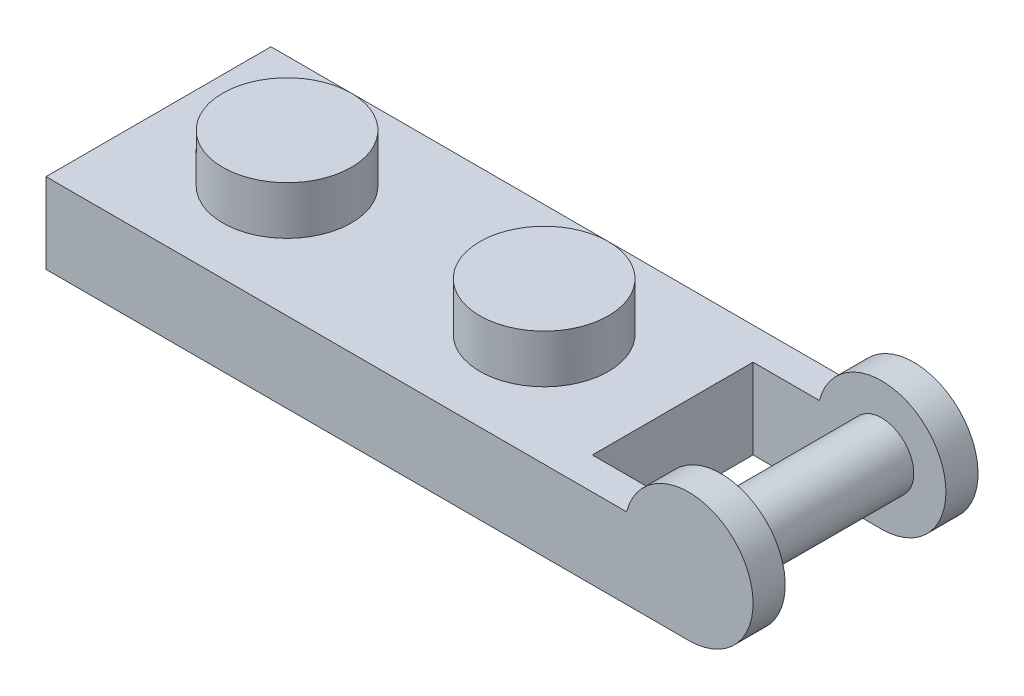
ISO-10303-21;
HEADER;
FILE_DESCRIPTION(('STEP AP214'),'2;1');
FILE_NAME('part.step','',(''),(''),'','','');
FILE_SCHEMA(('AUTOMOTIVE_DESIGN { 1 0 10303 214 1 1 1 1 }'));
ENDSEC;
DATA;
#1=APPLICATION_CONTEXT('core data for automotive mechanical design processes');
#2=APPLICATION_PROTOCOL_DEFINITION('international standard','automotive_design',2000,#1);
#3=PRODUCT_CONTEXT('',#1,'mechanical');
#4=PRODUCT('Part','Part','',(#3));
#5=PRODUCT_RELATED_PRODUCT_CATEGORY('part','',(#4));
#6=PRODUCT_DEFINITION_FORMATION('','',#4);
#7=PRODUCT_DEFINITION_CONTEXT('part definition',#1,'design');
#8=PRODUCT_DEFINITION('design','',#6,#7);
#9=PRODUCT_DEFINITION_SHAPE('','',#8);
#10=(LENGTH_UNIT() NAMED_UNIT(*) SI_UNIT(.MILLI.,.METRE.));
#11=(NAMED_UNIT(*) PLANE_ANGLE_UNIT() SI_UNIT($,.RADIAN.));
#12=(NAMED_UNIT(*) SI_UNIT($,.STERADIAN.) SOLID_ANGLE_UNIT());
#13=UNCERTAINTY_MEASURE_WITH_UNIT(LENGTH_MEASURE(1.E-05),#10,'distance_accuracy_value','');
#14=(GEOMETRIC_REPRESENTATION_CONTEXT(3) GLOBAL_UNCERTAINTY_ASSIGNED_CONTEXT((#13)) GLOBAL_UNIT_ASSIGNED_CONTEXT((#10,
#11,#12)) REPRESENTATION_CONTEXT('',''));
#15=CARTESIAN_POINT('',(0.,0.,0.));
#16=DIRECTION('',(0.,0.,1.));
#17=DIRECTION('',(1.,0.,0.));
#18=AXIS2_PLACEMENT_3D('',#15,#16,#17);
#19=CARTESIAN_POINT('',(10.16,0.,4.445));
#20=DIRECTION('',(-1.,0.,0.));
#21=DIRECTION('',(0.,0.,1.));
#22=AXIS2_PLACEMENT_3D('',#19,#20,#21);
#23=PLANE('',#22);
#24=DIRECTION('',(0.,-1.,0.));
#25=VECTOR('',#24,1.);
#26=CARTESIAN_POINT('',(10.16,-3.175,-3.175));
#27=LINE('',#26,#25);
#28=CARTESIAN_POINT('',(10.16,0.,-3.175));
#29=VERTEX_POINT('',#28);
#30=CARTESIAN_POINT('',(10.16,-3.175,-3.175));
#31=VERTEX_POINT('',#30);
#32=EDGE_CURVE('E76',#29,#31,#27,.T.);
#33=ORIENTED_EDGE('',*,*,#32,.F.);
#34=DIRECTION('',(0.,0.,-1.));
#35=VECTOR('',#34,1.);
#36=CARTESIAN_POINT('',(10.16,0.,4.445));
#37=LINE('',#36,#35);
#38=CARTESIAN_POINT('',(10.16,0.,3.175));
#39=VERTEX_POINT('',#38);
#40=EDGE_CURVE('E167',#39,#29,#37,.T.);
#41=ORIENTED_EDGE('',*,*,#40,.F.);
#42=DIRECTION('',(0.,-1.,0.));
#43=VECTOR('',#42,1.);
#44=CARTESIAN_POINT('',(10.16,-3.175,3.175));
#45=LINE('',#44,#43);
#46=CARTESIAN_POINT('',(10.16,-3.175,3.175));
#47=VERTEX_POINT('',#46);
#48=EDGE_CURVE('E175',#39,#47,#45,.T.);
#49=ORIENTED_EDGE('',*,*,#48,.T.);
#50=DIRECTION('',(0.,0.,-1.));
#51=VECTOR('',#50,1.);
#52=CARTESIAN_POINT('',(10.16,-3.175,4.445));
#53=LINE('',#52,#51);
#54=EDGE_CURVE('E71',#47,#31,#53,.T.);
#55=ORIENTED_EDGE('',*,*,#54,.T.);
#56=EDGE_LOOP('',(#33,#41,#49,#55));
#57=FACE_BOUND('',#56,.T.);
#58=ADVANCED_FACE('F55',(#57),#23,.F.);
#59=CARTESIAN_POINT('',(-10.16,-3.175,4.445));
#60=DIRECTION('',(1.,0.,0.));
#61=DIRECTION('',(0.,0.,-1.));
#62=AXIS2_PLACEMENT_3D('',#59,#60,#61);
#63=PLANE('',#62);
#64=DIRECTION('',(0.,-1.,0.));
#65=VECTOR('',#64,1.);
#66=CARTESIAN_POINT('',(-10.16,-3.175,-4.445));
#67=LINE('',#66,#65);
#68=CARTESIAN_POINT('',(-10.16,0.,-4.445));
#69=VERTEX_POINT('',#68);
#70=CARTESIAN_POINT('',(-10.16,-3.175,-4.445));
#71=VERTEX_POINT('',#70);
#72=EDGE_CURVE('E273',#69,#71,#67,.T.);
#73=ORIENTED_EDGE('',*,*,#72,.T.);
#74=DIRECTION('',(0.,0.,-1.));
#75=VECTOR('',#74,1.);
#76=CARTESIAN_POINT('',(-10.16,-3.175,4.445));
#77=LINE('',#76,#75);
#78=CARTESIAN_POINT('',(-10.16,-3.175,4.445));
#79=VERTEX_POINT('',#78);
#80=EDGE_CURVE('E301',#79,#71,#77,.T.);
#81=ORIENTED_EDGE('',*,*,#80,.F.);
#82=DIRECTION('',(0.,-1.,0.));
#83=VECTOR('',#82,1.);
#84=CARTESIAN_POINT('',(-10.16,-3.175,4.445));
#85=LINE('',#84,#83);
#86=CARTESIAN_POINT('',(-10.16,0.,4.445));
#87=VERTEX_POINT('',#86);
#88=EDGE_CURVE('E274',#87,#79,#85,.T.);
#89=ORIENTED_EDGE('',*,*,#88,.F.);
#90=DIRECTION('',(0.,0.,-1.));
#91=VECTOR('',#90,1.);
#92=CARTESIAN_POINT('',(-10.16,0.,4.445));
#93=LINE('',#92,#91);
#94=EDGE_CURVE('E285',#87,#69,#93,.T.);
#95=ORIENTED_EDGE('',*,*,#94,.T.);
#96=EDGE_LOOP('',(#73,#81,#89,#95));
#97=FACE_BOUND('',#96,.T.);
#98=ADVANCED_FACE('F57',(#97),#63,.F.);
#99=CARTESIAN_POINT('',(10.16,-3.175,4.445));
#100=DIRECTION('',(0.,1.,0.));
#101=DIRECTION('',(0.,0.,1.));
#102=AXIS2_PLACEMENT_3D('',#99,#100,#101);
#103=PLANE('',#102);
#104=DIRECTION('',(0.,0.,-1.));
#105=VECTOR('',#104,1.);
#106=CARTESIAN_POINT('',(-8.89,-3.175,2.54));
#107=LINE('',#106,#105);
#108=CARTESIAN_POINT('',(-8.89,-3.175,2.54));
#109=VERTEX_POINT('',#108);
#110=CARTESIAN_POINT('',(-8.89,-3.175,-2.54));
#111=VERTEX_POINT('',#110);
#112=EDGE_CURVE('E242',#109,#111,#107,.T.);
#113=ORIENTED_EDGE('',*,*,#112,.F.);
#114=DIRECTION('',(-1.,0.,0.));
#115=VECTOR('',#114,1.);
#116=CARTESIAN_POINT('',(8.89,-3.175,2.54));
#117=LINE('',#116,#115);
#118=CARTESIAN_POINT('',(8.89,-3.175,2.54));
#119=VERTEX_POINT('',#118);
#120=EDGE_CURVE('E210',#119,#109,#117,.T.);
#121=ORIENTED_EDGE('',*,*,#120,.F.);
#122=DIRECTION('',(0.,0.,1.));
#123=VECTOR('',#122,1.);
#124=CARTESIAN_POINT('',(8.89,-3.175,-2.54));
#125=LINE('',#124,#123);
#126=CARTESIAN_POINT('',(8.89,-3.175,-2.54));
#127=VERTEX_POINT('',#126);
#128=EDGE_CURVE('E227',#127,#119,#125,.T.);
#129=ORIENTED_EDGE('',*,*,#128,.F.);
#130=DIRECTION('',(1.,0.,0.));
#131=VECTOR('',#130,1.);
#132=CARTESIAN_POINT('',(-8.89,-3.175,-2.54));
#133=LINE('',#132,#131);
#134=EDGE_CURVE('E246',#111,#127,#133,.T.);
#135=ORIENTED_EDGE('',*,*,#134,.F.);
#136=EDGE_LOOP('',(#113,#121,#129,#135));
#137=FACE_BOUND('',#136,.T.);
#138=DIRECTION('',(1.,0.,0.));
#139=VECTOR('',#138,1.);
#140=CARTESIAN_POINT('',(10.16,-3.175,-4.445));
#141=LINE('',#140,#139);
#142=CARTESIAN_POINT('',(15.24,-3.175,-4.445));
#143=VERTEX_POINT('',#142);
#144=EDGE_CURVE('E289',#71,#143,#141,.T.);
#145=ORIENTED_EDGE('',*,*,#144,.T.);
#146=DIRECTION('',(0.,0.,-1.));
#147=VECTOR('',#146,1.);
#148=CARTESIAN_POINT('',(15.24,-3.175,-3.175));
#149=LINE('',#148,#147);
#150=CARTESIAN_POINT('',(15.24,-3.175,-3.175));
#151=VERTEX_POINT('',#150);
#152=EDGE_CURVE('E163',#151,#143,#149,.T.);
#153=ORIENTED_EDGE('',*,*,#152,.F.);
#154=DIRECTION('',(1.,0.,0.));
#155=VECTOR('',#154,1.);
#156=CARTESIAN_POINT('',(10.16,-3.175,-3.175));
#157=LINE('',#156,#155);
#158=EDGE_CURVE('E151',#31,#151,#157,.T.);
#159=ORIENTED_EDGE('',*,*,#158,.F.);
#160=ORIENTED_EDGE('',*,*,#54,.F.);
#161=DIRECTION('',(1.,0.,0.));
#162=VECTOR('',#161,1.);
#163=CARTESIAN_POINT('',(10.16,-3.175,3.175));
#164=LINE('',#163,#162);
#165=CARTESIAN_POINT('',(15.24,-3.175,3.175));
#166=VERTEX_POINT('',#165);
#167=EDGE_CURVE('E177',#47,#166,#164,.T.);
#168=ORIENTED_EDGE('',*,*,#167,.T.);
#169=DIRECTION('',(0.,0.,1.));
#170=VECTOR('',#169,1.);
#171=CARTESIAN_POINT('',(15.24,-3.175,3.175));
#172=LINE('',#171,#170);
#173=CARTESIAN_POINT('',(15.24,-3.175,4.445));
#174=VERTEX_POINT('',#173);
#175=EDGE_CURVE('E185',#166,#174,#172,.T.);
#176=ORIENTED_EDGE('',*,*,#175,.T.);
#177=DIRECTION('',(1.,0.,0.));
#178=VECTOR('',#177,1.);
#179=CARTESIAN_POINT('',(10.16,-3.175,4.445));
#180=LINE('',#179,#178);
#181=EDGE_CURVE('E278',#79,#174,#180,.T.);
#182=ORIENTED_EDGE('',*,*,#181,.F.);
#183=ORIENTED_EDGE('',*,*,#80,.T.);
#184=EDGE_LOOP('',(#145,#153,#159,#160,#168,#176,#182,#183));
#185=FACE_BOUND('',#184,.T.);
#186=ADVANCED_FACE('F338',(#137,#185),#103,.F.);
#187=CARTESIAN_POINT('',(-10.16,0.,4.445));
#188=DIRECTION('',(0.,-1.,0.));
#189=DIRECTION('',(0.,0.,-1.));
#190=AXIS2_PLACEMENT_3D('',#187,#188,#189);
#191=PLANE('',#190);
#192=CARTESIAN_POINT('',(5.08,0.,0.));
#193=DIRECTION('',(0.,-1.,0.));
#194=DIRECTION('',(0.,0.,-1.));
#195=AXIS2_PLACEMENT_3D('',#192,#193,#194);
#196=CIRCLE('',#195,2.54);
#197=CARTESIAN_POINT('',(5.08,0.,-2.54));
#198=VERTEX_POINT('',#197);
#199=EDGE_CURVE('E309',#198,#198,#196,.F.);
#200=ORIENTED_EDGE('',*,*,#199,.F.);
#201=EDGE_LOOP('',(#200));
#202=FACE_BOUND('',#201,.T.);
#203=CARTESIAN_POINT('',(-5.08,0.,0.));
#204=DIRECTION('',(0.,-1.,0.));
#205=DIRECTION('',(0.,0.,-1.));
#206=AXIS2_PLACEMENT_3D('',#203,#204,#205);
#207=CIRCLE('',#206,2.54);
#208=CARTESIAN_POINT('',(-5.08,0.,-2.54));
#209=VERTEX_POINT('',#208);
#210=EDGE_CURVE('E305',#209,#209,#207,.F.);
#211=ORIENTED_EDGE('',*,*,#210,.F.);
#212=EDGE_LOOP('',(#211));
#213=FACE_BOUND('',#212,.T.);
#214=DIRECTION('',(-1.,0.,0.));
#215=VECTOR('',#214,1.);
#216=CARTESIAN_POINT('',(-10.16,0.,-4.445));
#217=LINE('',#216,#215);
#218=CARTESIAN_POINT('',(12.7806555751583,0.,-4.445));
#219=VERTEX_POINT('',#218);
#220=EDGE_CURVE('E279',#219,#69,#217,.T.);
#221=ORIENTED_EDGE('',*,*,#220,.T.);
#222=ORIENTED_EDGE('',*,*,#94,.F.);
#223=DIRECTION('',(-1.,0.,0.));
#224=VECTOR('',#223,1.);
#225=CARTESIAN_POINT('',(-10.16,0.,4.445));
#226=LINE('',#225,#224);
#227=CARTESIAN_POINT('',(12.7806555751583,0.,4.445));
#228=VERTEX_POINT('',#227);
#229=EDGE_CURVE('E282',#228,#87,#226,.T.);
#230=ORIENTED_EDGE('',*,*,#229,.F.);
#231=DIRECTION('',(0.,0.,1.));
#232=VECTOR('',#231,1.);
#233=CARTESIAN_POINT('',(12.7806555751583,0.,3.175));
#234=LINE('',#233,#232);
#235=CARTESIAN_POINT('',(12.7806555751583,0.,3.175));
#236=VERTEX_POINT('',#235);
#237=EDGE_CURVE('E188',#236,#228,#234,.T.);
#238=ORIENTED_EDGE('',*,*,#237,.F.);
#239=DIRECTION('',(-1.,0.,0.));
#240=VECTOR('',#239,1.);
#241=CARTESIAN_POINT('',(10.16,0.,3.175));
#242=LINE('',#241,#240);
#243=EDGE_CURVE('E183',#236,#39,#242,.T.);
#244=ORIENTED_EDGE('',*,*,#243,.T.);
#245=ORIENTED_EDGE('',*,*,#40,.T.);
#246=DIRECTION('',(-1.,0.,0.));
#247=VECTOR('',#246,1.);
#248=CARTESIAN_POINT('',(10.16,0.,-3.175));
#249=LINE('',#248,#247);
#250=CARTESIAN_POINT('',(12.7806555751583,0.,-3.175));
#251=VERTEX_POINT('',#250);
#252=EDGE_CURVE('E150',#251,#29,#249,.T.);
#253=ORIENTED_EDGE('',*,*,#252,.F.);
#254=DIRECTION('',(0.,0.,-1.));
#255=VECTOR('',#254,1.);
#256=CARTESIAN_POINT('',(12.7806555751583,0.,-3.175));
#257=LINE('',#256,#255);
#258=EDGE_CURVE('E158',#251,#219,#257,.T.);
#259=ORIENTED_EDGE('',*,*,#258,.T.);
#260=EDGE_LOOP('',(#221,#222,#230,#238,#244,#245,#253,#259));
#261=FACE_BOUND('',#260,.T.);
#262=ADVANCED_FACE('F165',(#202,#213,#261),#191,.F.);
#263=CARTESIAN_POINT('',(0.,0.,4.445));
#264=DIRECTION('',(0.,0.,-1.));
#265=DIRECTION('',(-1.,0.,0.));
#266=AXIS2_PLACEMENT_3D('',#263,#264,#265);
#267=PLANE('',#266);
#268=ORIENTED_EDGE('',*,*,#88,.T.);
#269=ORIENTED_EDGE('',*,*,#181,.T.);
#270=CARTESIAN_POINT('',(15.24,-0.635,4.445));
#271=DIRECTION('',(0.,0.,1.));
#272=DIRECTION('',(1.,0.,0.));
#273=AXIS2_PLACEMENT_3D('',#270,#271,#272);
#274=CIRCLE('',#273,2.54);
#275=EDGE_CURVE('E173',#174,#228,#274,.T.);
#276=ORIENTED_EDGE('',*,*,#275,.T.);
#277=ORIENTED_EDGE('',*,*,#229,.T.);
#278=EDGE_LOOP('',(#268,#269,#276,#277));
#279=FACE_BOUND('',#278,.T.);
#280=ADVANCED_FACE('F347',(#279),#267,.F.);
#281=CARTESIAN_POINT('',(0.,0.,-4.445));
#282=DIRECTION('',(0.,0.,-1.));
#283=DIRECTION('',(-1.,0.,0.));
#284=AXIS2_PLACEMENT_3D('',#281,#282,#283);
#285=PLANE('',#284);
#286=ORIENTED_EDGE('',*,*,#72,.F.);
#287=ORIENTED_EDGE('',*,*,#220,.F.);
#288=CARTESIAN_POINT('',(15.24,-0.635,-4.445));
#289=DIRECTION('',(0.,0.,1.));
#290=DIRECTION('',(1.,0.,0.));
#291=AXIS2_PLACEMENT_3D('',#288,#289,#290);
#292=CIRCLE('',#291,2.54);
#293=EDGE_CURVE('E161',#143,#219,#292,.T.);
#294=ORIENTED_EDGE('',*,*,#293,.F.);
#295=ORIENTED_EDGE('',*,*,#144,.F.);
#296=EDGE_LOOP('',(#286,#287,#294,#295));
#297=FACE_BOUND('',#296,.T.);
#298=ADVANCED_FACE('F356',(#297),#285,.T.);
#299=CARTESIAN_POINT('',(-5.08,1.905,0.));
#300=DIRECTION('',(0.,-1.,0.));
#301=DIRECTION('',(0.,0.,-1.));
#302=AXIS2_PLACEMENT_3D('',#299,#300,#301);
#303=CYLINDRICAL_SURFACE('',#302,2.54);
#304=CARTESIAN_POINT('',(-5.08,1.905,0.));
#305=DIRECTION('',(0.,1.,0.));
#306=DIRECTION('',(0.,0.,1.));
#307=AXIS2_PLACEMENT_3D('',#304,#305,#306);
#308=CIRCLE('',#307,2.54);
#309=CARTESIAN_POINT('',(-5.08,1.905,2.54));
#310=VERTEX_POINT('',#309);
#311=EDGE_CURVE('E269',#310,#310,#308,.T.);
#312=ORIENTED_EDGE('',*,*,#311,.F.);
#313=EDGE_LOOP('',(#312));
#314=FACE_BOUND('',#313,.T.);
#315=ORIENTED_EDGE('',*,*,#210,.T.);
#316=EDGE_LOOP('',(#315));
#317=FACE_BOUND('',#316,.T.);
#318=ADVANCED_FACE('F435',(#314,#317),#303,.T.);
#319=CARTESIAN_POINT('',(-5.08,1.905,0.));
#320=DIRECTION('',(0.,1.,0.));
#321=DIRECTION('',(0.,0.,1.));
#322=AXIS2_PLACEMENT_3D('',#319,#320,#321);
#323=PLANE('',#322);
#324=ORIENTED_EDGE('',*,*,#311,.T.);
#325=EDGE_LOOP('',(#324));
#326=FACE_BOUND('',#325,.T.);
#327=ADVANCED_FACE('F431',(#326),#323,.T.);
#328=CARTESIAN_POINT('',(5.08,1.905,0.));
#329=DIRECTION('',(0.,-1.,0.));
#330=DIRECTION('',(0.,0.,-1.));
#331=AXIS2_PLACEMENT_3D('',#328,#329,#330);
#332=CYLINDRICAL_SURFACE('',#331,2.54);
#333=CARTESIAN_POINT('',(5.08,1.905,0.));
#334=DIRECTION('',(0.,1.,0.));
#335=DIRECTION('',(0.,0.,1.));
#336=AXIS2_PLACEMENT_3D('',#333,#334,#335);
#337=CIRCLE('',#336,2.54);
#338=CARTESIAN_POINT('',(5.08,1.905,2.54));
#339=VERTEX_POINT('',#338);
#340=EDGE_CURVE('E256',#339,#339,#337,.T.);
#341=ORIENTED_EDGE('',*,*,#340,.F.);
#342=EDGE_LOOP('',(#341));
#343=FACE_BOUND('',#342,.T.);
#344=ORIENTED_EDGE('',*,*,#199,.T.);
#345=EDGE_LOOP('',(#344));
#346=FACE_BOUND('',#345,.T.);
#347=ADVANCED_FACE('F427',(#343,#346),#332,.T.);
#348=CARTESIAN_POINT('',(5.08,1.905,0.));
#349=DIRECTION('',(0.,1.,0.));
#350=DIRECTION('',(0.,0.,1.));
#351=AXIS2_PLACEMENT_3D('',#348,#349,#350);
#352=PLANE('',#351);
#353=ORIENTED_EDGE('',*,*,#340,.T.);
#354=EDGE_LOOP('',(#353));
#355=FACE_BOUND('',#354,.T.);
#356=ADVANCED_FACE('F423',(#355),#352,.T.);
#357=CARTESIAN_POINT('',(8.89,-1.27,2.54));
#358=DIRECTION('',(0.,0.,1.));
#359=DIRECTION('',(1.,0.,0.));
#360=AXIS2_PLACEMENT_3D('',#357,#358,#359);
#361=PLANE('',#360);
#362=ORIENTED_EDGE('',*,*,#120,.T.);
#363=DIRECTION('',(0.,-1.,0.));
#364=VECTOR('',#363,1.);
#365=CARTESIAN_POINT('',(-8.89,-1.27,2.54));
#366=LINE('',#365,#364);
#367=CARTESIAN_POINT('',(-8.89,-1.27,2.54));
#368=VERTEX_POINT('',#367);
#369=EDGE_CURVE('E239',#368,#109,#366,.T.);
#370=ORIENTED_EDGE('',*,*,#369,.F.);
#371=DIRECTION('',(-1.,0.,0.));
#372=VECTOR('',#371,1.);
#373=CARTESIAN_POINT('',(8.89,-1.27,2.54));
#374=LINE('',#373,#372);
#375=CARTESIAN_POINT('',(8.89,-1.27,2.54));
#376=VERTEX_POINT('',#375);
#377=EDGE_CURVE('E222',#376,#368,#374,.T.);
#378=ORIENTED_EDGE('',*,*,#377,.F.);
#379=DIRECTION('',(0.,-1.,0.));
#380=VECTOR('',#379,1.);
#381=CARTESIAN_POINT('',(8.89,-1.27,2.54));
#382=LINE('',#381,#380);
#383=EDGE_CURVE('E253',#376,#119,#382,.T.);
#384=ORIENTED_EDGE('',*,*,#383,.T.);
#385=EDGE_LOOP('',(#362,#370,#378,#384));
#386=FACE_BOUND('',#385,.T.);
#387=ADVANCED_FACE('F413',(#386),#361,.F.);
#388=CARTESIAN_POINT('',(8.89,-1.27,-2.54));
#389=DIRECTION('',(1.,0.,0.));
#390=DIRECTION('',(0.,0.,-1.));
#391=AXIS2_PLACEMENT_3D('',#388,#389,#390);
#392=PLANE('',#391);
#393=ORIENTED_EDGE('',*,*,#128,.T.);
#394=ORIENTED_EDGE('',*,*,#383,.F.);
#395=DIRECTION('',(0.,0.,1.));
#396=VECTOR('',#395,1.);
#397=CARTESIAN_POINT('',(8.89,-1.27,-2.54));
#398=LINE('',#397,#396);
#399=CARTESIAN_POINT('',(8.89,-1.27,-2.54));
#400=VERTEX_POINT('',#399);
#401=EDGE_CURVE('E235',#400,#376,#398,.T.);
#402=ORIENTED_EDGE('',*,*,#401,.F.);
#403=DIRECTION('',(0.,-1.,0.));
#404=VECTOR('',#403,1.);
#405=CARTESIAN_POINT('',(8.89,-1.27,-2.54));
#406=LINE('',#405,#404);
#407=EDGE_CURVE('E257',#400,#127,#406,.T.);
#408=ORIENTED_EDGE('',*,*,#407,.T.);
#409=EDGE_LOOP('',(#393,#394,#402,#408));
#410=FACE_BOUND('',#409,.T.);
#411=ADVANCED_FACE('F409',(#410),#392,.F.);
#412=CARTESIAN_POINT('',(-8.89,-1.27,-2.54));
#413=DIRECTION('',(0.,0.,-1.));
#414=DIRECTION('',(-1.,0.,0.));
#415=AXIS2_PLACEMENT_3D('',#412,#413,#414);
#416=PLANE('',#415);
#417=ORIENTED_EDGE('',*,*,#134,.T.);
#418=ORIENTED_EDGE('',*,*,#407,.F.);
#419=DIRECTION('',(1.,0.,0.));
#420=VECTOR('',#419,1.);
#421=CARTESIAN_POINT('',(-8.89,-1.27,-2.54));
#422=LINE('',#421,#420);
#423=CARTESIAN_POINT('',(-8.89,-1.27,-2.54));
#424=VERTEX_POINT('',#423);
#425=EDGE_CURVE('E231',#424,#400,#422,.T.);
#426=ORIENTED_EDGE('',*,*,#425,.F.);
#427=DIRECTION('',(0.,-1.,0.));
#428=VECTOR('',#427,1.);
#429=CARTESIAN_POINT('',(-8.89,-1.27,-2.54));
#430=LINE('',#429,#428);
#431=EDGE_CURVE('E260',#424,#111,#430,.T.);
#432=ORIENTED_EDGE('',*,*,#431,.T.);
#433=EDGE_LOOP('',(#417,#418,#426,#432));
#434=FACE_BOUND('',#433,.T.);
#435=ADVANCED_FACE('F412',(#434),#416,.F.);
#436=CARTESIAN_POINT('',(-8.89,-1.27,2.54));
#437=DIRECTION('',(-1.,0.,0.));
#438=DIRECTION('',(0.,0.,1.));
#439=AXIS2_PLACEMENT_3D('',#436,#437,#438);
#440=PLANE('',#439);
#441=ORIENTED_EDGE('',*,*,#112,.T.);
#442=ORIENTED_EDGE('',*,*,#431,.F.);
#443=DIRECTION('',(0.,0.,-1.));
#444=VECTOR('',#443,1.);
#445=CARTESIAN_POINT('',(-8.89,-1.27,2.54));
#446=LINE('',#445,#444);
#447=EDGE_CURVE('E226',#368,#424,#446,.T.);
#448=ORIENTED_EDGE('',*,*,#447,.F.);
#449=ORIENTED_EDGE('',*,*,#369,.T.);
#450=EDGE_LOOP('',(#441,#442,#448,#449));
#451=FACE_BOUND('',#450,.T.);
#452=ADVANCED_FACE('F407',(#451),#440,.F.);
#453=CARTESIAN_POINT('',(0.,-1.27,0.));
#454=DIRECTION('',(0.,-1.,0.));
#455=DIRECTION('',(0.,0.,-1.));
#456=AXIS2_PLACEMENT_3D('',#453,#454,#455);
#457=PLANE('',#456);
#458=CARTESIAN_POINT('',(0.,-1.27,0.));
#459=DIRECTION('',(0.,-1.,0.));
#460=DIRECTION('',(0.,0.,-1.));
#461=AXIS2_PLACEMENT_3D('',#458,#459,#460);
#462=CIRCLE('',#461,1.905);
#463=CARTESIAN_POINT('',(0.,-1.27,-1.905));
#464=VERTEX_POINT('',#463);
#465=EDGE_CURVE('E194',#464,#464,#462,.T.);
#466=ORIENTED_EDGE('',*,*,#465,.F.);
#467=EDGE_LOOP('',(#466));
#468=FACE_BOUND('',#467,.T.);
#469=CARTESIAN_POINT('',(-5.08,-1.27,0.));
#470=DIRECTION('',(0.,-1.,0.));
#471=DIRECTION('',(0.,0.,-1.));
#472=AXIS2_PLACEMENT_3D('',#469,#470,#471);
#473=CIRCLE('',#472,1.905);
#474=CARTESIAN_POINT('',(-5.08,-1.27,-1.905));
#475=VERTEX_POINT('',#474);
#476=EDGE_CURVE('E211',#475,#475,#473,.T.);
#477=ORIENTED_EDGE('',*,*,#476,.F.);
#478=EDGE_LOOP('',(#477));
#479=FACE_BOUND('',#478,.T.);
#480=CARTESIAN_POINT('',(5.08,-1.27,0.));
#481=DIRECTION('',(0.,-1.,0.));
#482=DIRECTION('',(0.,0.,-1.));
#483=AXIS2_PLACEMENT_3D('',#480,#481,#482);
#484=CIRCLE('',#483,1.905);
#485=CARTESIAN_POINT('',(5.08,-1.27,-1.905));
#486=VERTEX_POINT('',#485);
#487=EDGE_CURVE('E205',#486,#486,#484,.T.);
#488=ORIENTED_EDGE('',*,*,#487,.F.);
#489=EDGE_LOOP('',(#488));
#490=FACE_BOUND('',#489,.T.);
#491=ORIENTED_EDGE('',*,*,#377,.T.);
#492=ORIENTED_EDGE('',*,*,#447,.T.);
#493=ORIENTED_EDGE('',*,*,#425,.T.);
#494=ORIENTED_EDGE('',*,*,#401,.T.);
#495=EDGE_LOOP('',(#491,#492,#493,#494));
#496=FACE_BOUND('',#495,.T.);
#497=ADVANCED_FACE('F403',(#468,#479,#490,#496),#457,.T.);
#498=CARTESIAN_POINT('',(5.08,1.27,0.));
#499=DIRECTION('',(0.,-1.,0.));
#500=DIRECTION('',(0.,0.,-1.));
#501=AXIS2_PLACEMENT_3D('',#498,#499,#500);
#502=CYLINDRICAL_SURFACE('',#501,1.905);
#503=CARTESIAN_POINT('',(5.08,1.27,0.));
#504=DIRECTION('',(0.,-1.,0.));
#505=DIRECTION('',(0.,0.,-1.));
#506=AXIS2_PLACEMENT_3D('',#503,#504,#505);
#507=CIRCLE('',#506,1.905);
#508=CARTESIAN_POINT('',(5.08,1.27,-1.905));
#509=VERTEX_POINT('',#508);
#510=EDGE_CURVE('E215',#509,#509,#507,.T.);
#511=ORIENTED_EDGE('',*,*,#510,.F.);
#512=EDGE_LOOP('',(#511));
#513=FACE_BOUND('',#512,.T.);
#514=ORIENTED_EDGE('',*,*,#487,.T.);
#515=EDGE_LOOP('',(#514));
#516=FACE_BOUND('',#515,.T.);
#517=ADVANCED_FACE('F399',(#513,#516),#502,.F.);
#518=CARTESIAN_POINT('',(5.08,1.27,0.));
#519=DIRECTION('',(0.,-1.,0.));
#520=DIRECTION('',(0.,0.,-1.));
#521=AXIS2_PLACEMENT_3D('',#518,#519,#520);
#522=PLANE('',#521);
#523=ORIENTED_EDGE('',*,*,#510,.T.);
#524=EDGE_LOOP('',(#523));
#525=FACE_BOUND('',#524,.T.);
#526=ADVANCED_FACE('F395',(#525),#522,.T.);
#527=CARTESIAN_POINT('',(-5.08,1.27,0.));
#528=DIRECTION('',(0.,-1.,0.));
#529=DIRECTION('',(0.,0.,-1.));
#530=AXIS2_PLACEMENT_3D('',#527,#528,#529);
#531=CYLINDRICAL_SURFACE('',#530,1.905);
#532=CARTESIAN_POINT('',(-5.08,1.27,0.));
#533=DIRECTION('',(0.,-1.,0.));
#534=DIRECTION('',(0.,0.,-1.));
#535=AXIS2_PLACEMENT_3D('',#532,#533,#534);
#536=CIRCLE('',#535,1.905);
#537=CARTESIAN_POINT('',(-5.08,1.27,-1.905));
#538=VERTEX_POINT('',#537);
#539=EDGE_CURVE('E206',#538,#538,#536,.T.);
#540=ORIENTED_EDGE('',*,*,#539,.F.);
#541=EDGE_LOOP('',(#540));
#542=FACE_BOUND('',#541,.T.);
#543=ORIENTED_EDGE('',*,*,#476,.T.);
#544=EDGE_LOOP('',(#543));
#545=FACE_BOUND('',#544,.T.);
#546=ADVANCED_FACE('F391',(#542,#545),#531,.F.);
#547=CARTESIAN_POINT('',(-5.08,1.27,0.));
#548=DIRECTION('',(0.,-1.,0.));
#549=DIRECTION('',(0.,0.,-1.));
#550=AXIS2_PLACEMENT_3D('',#547,#548,#549);
#551=PLANE('',#550);
#552=ORIENTED_EDGE('',*,*,#539,.T.);
#553=EDGE_LOOP('',(#552));
#554=FACE_BOUND('',#553,.T.);
#555=ADVANCED_FACE('F380',(#554),#551,.T.);
#556=CARTESIAN_POINT('',(0.,-8.56315367264149,0.));
#557=DIRECTION('',(0.,1.,0.));
#558=DIRECTION('',(0.,0.,1.));
#559=AXIS2_PLACEMENT_3D('',#556,#557,#558);
#560=CYLINDRICAL_SURFACE('',#559,1.905);
#561=CARTESIAN_POINT('',(0.,-3.175,0.));
#562=DIRECTION('',(0.,1.,0.));
#563=DIRECTION('',(0.,0.,1.));
#564=AXIS2_PLACEMENT_3D('',#561,#562,#563);
#565=CIRCLE('',#564,1.905);
#566=CARTESIAN_POINT('',(0.,-3.175,1.905));
#567=VERTEX_POINT('',#566);
#568=EDGE_CURVE('E191',#567,#567,#565,.T.);
#569=ORIENTED_EDGE('',*,*,#568,.T.);
#570=EDGE_LOOP('',(#569));
#571=FACE_BOUND('',#570,.T.);
#572=ORIENTED_EDGE('',*,*,#465,.T.);
#573=EDGE_LOOP('',(#572));
#574=FACE_BOUND('',#573,.T.);
#575=ADVANCED_FACE('F376',(#571,#574),#560,.T.);
#576=CARTESIAN_POINT('',(0.,-8.56315367264149,0.));
#577=DIRECTION('',(0.,1.,0.));
#578=DIRECTION('',(0.,0.,1.));
#579=AXIS2_PLACEMENT_3D('',#576,#577,#578);
#580=CYLINDRICAL_SURFACE('',#579,0.9525);
#581=CARTESIAN_POINT('',(0.,-3.175,0.));
#582=DIRECTION('',(0.,1.,0.));
#583=DIRECTION('',(0.,0.,1.));
#584=AXIS2_PLACEMENT_3D('',#581,#582,#583);
#585=CIRCLE('',#584,0.9525);
#586=CARTESIAN_POINT('',(0.,-3.175,0.9525));
#587=VERTEX_POINT('',#586);
#588=EDGE_CURVE('E198',#587,#587,#585,.T.);
#589=ORIENTED_EDGE('',*,*,#588,.F.);
#590=EDGE_LOOP('',(#589));
#591=FACE_BOUND('',#590,.T.);
#592=CARTESIAN_POINT('',(0.,-1.27,0.));
#593=DIRECTION('',(0.,-1.,0.));
#594=DIRECTION('',(0.,0.,-1.));
#595=AXIS2_PLACEMENT_3D('',#592,#593,#594);
#596=CIRCLE('',#595,0.9525);
#597=CARTESIAN_POINT('',(0.,-1.27,-0.9525));
#598=VERTEX_POINT('',#597);
#599=EDGE_CURVE('E312',#598,#598,#596,.F.);
#600=ORIENTED_EDGE('',*,*,#599,.T.);
#601=EDGE_LOOP('',(#600));
#602=FACE_BOUND('',#601,.T.);
#603=ADVANCED_FACE('F379',(#591,#602),#580,.F.);
#604=CARTESIAN_POINT('',(10.16,-3.175,4.445));
#605=DIRECTION('',(0.,1.,0.));
#606=DIRECTION('',(0.,0.,1.));
#607=AXIS2_PLACEMENT_3D('',#604,#605,#606);
#608=PLANE('',#607);
#609=ORIENTED_EDGE('',*,*,#588,.T.);
#610=EDGE_LOOP('',(#609));
#611=FACE_BOUND('',#610,.T.);
#612=ORIENTED_EDGE('',*,*,#568,.F.);
#613=EDGE_LOOP('',(#612));
#614=FACE_BOUND('',#613,.T.);
#615=ADVANCED_FACE('F384',(#611,#614),#608,.F.);
#616=ORIENTED_EDGE('',*,*,#599,.F.);
#617=EDGE_LOOP('',(#616));
#618=FACE_BOUND('',#617,.T.);
#619=ADVANCED_FACE('F372',(#618),#457,.T.);
#620=CARTESIAN_POINT('',(15.24,-0.635,3.175));
#621=DIRECTION('',(0.,0.,1.));
#622=DIRECTION('',(1.,0.,0.));
#623=AXIS2_PLACEMENT_3D('',#620,#621,#622);
#624=CYLINDRICAL_SURFACE('',#623,2.54);
#625=ORIENTED_EDGE('',*,*,#275,.F.);
#626=ORIENTED_EDGE('',*,*,#175,.F.);
#627=CARTESIAN_POINT('',(15.24,-0.635,3.175));
#628=DIRECTION('',(0.,0.,1.));
#629=DIRECTION('',(1.,0.,0.));
#630=AXIS2_PLACEMENT_3D('',#627,#628,#629);
#631=CIRCLE('',#630,2.54);
#632=EDGE_CURVE('E180',#166,#236,#631,.T.);
#633=ORIENTED_EDGE('',*,*,#632,.T.);
#634=ORIENTED_EDGE('',*,*,#237,.T.);
#635=EDGE_LOOP('',(#625,#626,#633,#634));
#636=FACE_BOUND('',#635,.T.);
#637=ADVANCED_FACE('F362',(#636),#624,.T.);
#638=CARTESIAN_POINT('',(15.24,-0.635,3.175));
#639=DIRECTION('',(0.,0.,1.));
#640=DIRECTION('',(1.,0.,0.));
#641=AXIS2_PLACEMENT_3D('',#638,#639,#640);
#642=PLANE('',#641);
#643=CARTESIAN_POINT('',(15.24,-0.635,3.175));
#644=DIRECTION('',(0.,0.,1.));
#645=DIRECTION('',(1.,0.,0.));
#646=AXIS2_PLACEMENT_3D('',#643,#644,#645);
#647=CIRCLE('',#646,1.27);
#648=CARTESIAN_POINT('',(16.51,-0.635,3.175));
#649=VERTEX_POINT('',#648);
#650=EDGE_CURVE('E13',#649,#649,#647,.F.);
#651=ORIENTED_EDGE('',*,*,#650,.F.);
#652=EDGE_LOOP('',(#651));
#653=FACE_BOUND('',#652,.T.);
#654=ORIENTED_EDGE('',*,*,#48,.F.);
#655=ORIENTED_EDGE('',*,*,#243,.F.);
#656=ORIENTED_EDGE('',*,*,#632,.F.);
#657=ORIENTED_EDGE('',*,*,#167,.F.);
#658=EDGE_LOOP('',(#654,#655,#656,#657));
#659=FACE_BOUND('',#658,.T.);
#660=ADVANCED_FACE('F331',(#653,#659),#642,.F.);
#661=CARTESIAN_POINT('',(15.24,-0.635,-3.175));
#662=DIRECTION('',(0.,0.,-1.));
#663=DIRECTION('',(-1.,0.,0.));
#664=AXIS2_PLACEMENT_3D('',#661,#662,#663);
#665=CYLINDRICAL_SURFACE('',#664,2.54);
#666=ORIENTED_EDGE('',*,*,#293,.T.);
#667=ORIENTED_EDGE('',*,*,#258,.F.);
#668=CARTESIAN_POINT('',(15.24,-0.635,-3.175));
#669=DIRECTION('',(0.,0.,1.));
#670=DIRECTION('',(1.,0.,0.));
#671=AXIS2_PLACEMENT_3D('',#668,#669,#670);
#672=CIRCLE('',#671,2.54);
#673=EDGE_CURVE('E146',#151,#251,#672,.T.);
#674=ORIENTED_EDGE('',*,*,#673,.F.);
#675=ORIENTED_EDGE('',*,*,#152,.T.);
#676=EDGE_LOOP('',(#666,#667,#674,#675));
#677=FACE_BOUND('',#676,.T.);
#678=ADVANCED_FACE('F159',(#677),#665,.T.);
#679=CARTESIAN_POINT('',(15.24,-0.635,-3.175));
#680=DIRECTION('',(0.,0.,-1.));
#681=DIRECTION('',(1.,0.,0.));
#682=AXIS2_PLACEMENT_3D('',#679,#680,#681);
#683=PLANE('',#682);
#684=CARTESIAN_POINT('',(15.24,-0.635,-3.175));
#685=DIRECTION('',(0.,0.,-1.));
#686=DIRECTION('',(-1.,0.,0.));
#687=AXIS2_PLACEMENT_3D('',#684,#685,#686);
#688=CIRCLE('',#687,1.27);
#689=CARTESIAN_POINT('',(13.97,-0.635,-3.175));
#690=VERTEX_POINT('',#689);
#691=EDGE_CURVE('E59',#690,#690,#688,.F.);
#692=ORIENTED_EDGE('',*,*,#691,.F.);
#693=EDGE_LOOP('',(#692));
#694=FACE_BOUND('',#693,.T.);
#695=ORIENTED_EDGE('',*,*,#32,.T.);
#696=ORIENTED_EDGE('',*,*,#158,.T.);
#697=ORIENTED_EDGE('',*,*,#673,.T.);
#698=ORIENTED_EDGE('',*,*,#252,.T.);
#699=EDGE_LOOP('',(#695,#696,#697,#698));
#700=FACE_BOUND('',#699,.T.);
#701=ADVANCED_FACE('F148',(#694,#700),#683,.F.);
#702=CARTESIAN_POINT('',(15.24,-0.635,4.445));
#703=DIRECTION('',(0.,0.,-1.));
#704=DIRECTION('',(-1.,0.,0.));
#705=AXIS2_PLACEMENT_3D('',#702,#703,#704);
#706=CYLINDRICAL_SURFACE('',#705,1.27);
#707=ORIENTED_EDGE('',*,*,#691,.T.);
#708=EDGE_LOOP('',(#707));
#709=FACE_BOUND('',#708,.T.);
#710=ORIENTED_EDGE('',*,*,#650,.T.);
#711=EDGE_LOOP('',(#710));
#712=FACE_BOUND('',#711,.T.);
#713=ADVANCED_FACE('F321',(#709,#712),#706,.T.);
#714=CLOSED_SHELL('',(#58,#98,#186,#262,#280,#298,#318,#327,#347,#356,#387,#411,#435,#452,#497,
#517,#526,#546,#555,#575,#603,#615,#619,#637,#660,#678,#701,#713));
#715=MANIFOLD_SOLID_BREP('B2',#714);
#716=ADVANCED_BREP_SHAPE_REPRESENTATION('',(#18,#715),#14);
#717=SHAPE_DEFINITION_REPRESENTATION(#9,#716);
ENDSEC;
END-ISO-10303-21;
